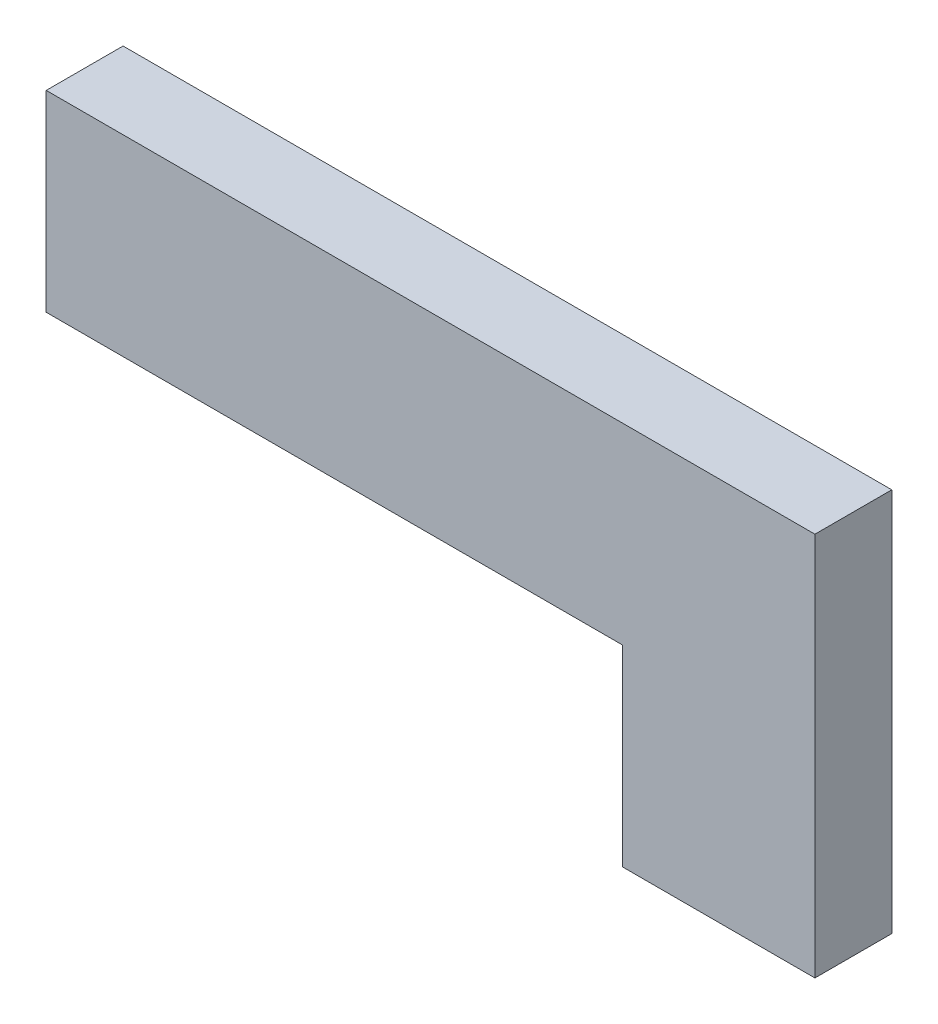
ISO-10303-21;
HEADER;
FILE_DESCRIPTION(('STEP AP214'),'2;1');
FILE_NAME('part.step','',(''),(''),'','','');
FILE_SCHEMA(('AUTOMOTIVE_DESIGN { 1 0 10303 214 1 1 1 1 }'));
ENDSEC;
DATA;
#1=APPLICATION_CONTEXT('core data for automotive mechanical design processes');
#2=APPLICATION_PROTOCOL_DEFINITION('international standard','automotive_design',2000,#1);
#3=PRODUCT_CONTEXT('',#1,'mechanical');
#4=PRODUCT('Part','Part','',(#3));
#5=PRODUCT_RELATED_PRODUCT_CATEGORY('part','',(#4));
#6=PRODUCT_DEFINITION_FORMATION('','',#4);
#7=PRODUCT_DEFINITION_CONTEXT('part definition',#1,'design');
#8=PRODUCT_DEFINITION('design','',#6,#7);
#9=PRODUCT_DEFINITION_SHAPE('','',#8);
#10=(LENGTH_UNIT() NAMED_UNIT(*) SI_UNIT(.MILLI.,.METRE.));
#11=(NAMED_UNIT(*) PLANE_ANGLE_UNIT() SI_UNIT($,.RADIAN.));
#12=(NAMED_UNIT(*) SI_UNIT($,.STERADIAN.) SOLID_ANGLE_UNIT());
#13=UNCERTAINTY_MEASURE_WITH_UNIT(LENGTH_MEASURE(1.E-05),#10,'distance_accuracy_value','');
#14=(GEOMETRIC_REPRESENTATION_CONTEXT(3) GLOBAL_UNCERTAINTY_ASSIGNED_CONTEXT((#13)) GLOBAL_UNIT_ASSIGNED_CONTEXT((#10,
#11,#12)) REPRESENTATION_CONTEXT('',''));
#15=CARTESIAN_POINT('',(0.,0.,0.));
#16=DIRECTION('',(0.,0.,1.));
#17=DIRECTION('',(1.,0.,0.));
#18=AXIS2_PLACEMENT_3D('',#15,#16,#17);
#19=CARTESIAN_POINT('',(0.,-5.,2.));
#20=DIRECTION('',(1.,0.,0.));
#21=DIRECTION('',(0.,1.,0.));
#22=AXIS2_PLACEMENT_3D('',#19,#20,#21);
#23=PLANE('',#22);
#24=DIRECTION('',(0.,-1.,0.));
#25=VECTOR('',#24,1.);
#26=CARTESIAN_POINT('',(0.,-5.,0.));
#27=LINE('',#26,#25);
#28=CARTESIAN_POINT('',(0.,0.,0.));
#29=VERTEX_POINT('',#28);
#30=CARTESIAN_POINT('',(0.,-5.,0.));
#31=VERTEX_POINT('',#30);
#32=EDGE_CURVE('E128',#29,#31,#27,.T.);
#33=ORIENTED_EDGE('',*,*,#32,.T.);
#34=DIRECTION('',(0.,0.,-1.));
#35=VECTOR('',#34,1.);
#36=CARTESIAN_POINT('',(0.,-5.,2.));
#37=LINE('',#36,#35);
#38=CARTESIAN_POINT('',(0.,-5.,2.));
#39=VERTEX_POINT('',#38);
#40=EDGE_CURVE('E11',#39,#31,#37,.T.);
#41=ORIENTED_EDGE('',*,*,#40,.F.);
#42=DIRECTION('',(0.,-1.,0.));
#43=VECTOR('',#42,1.);
#44=CARTESIAN_POINT('',(0.,-5.,2.));
#45=LINE('',#44,#43);
#46=CARTESIAN_POINT('',(0.,0.,2.));
#47=VERTEX_POINT('',#46);
#48=EDGE_CURVE('E144',#47,#39,#45,.T.);
#49=ORIENTED_EDGE('',*,*,#48,.F.);
#50=DIRECTION('',(0.,0.,-1.));
#51=VECTOR('',#50,1.);
#52=CARTESIAN_POINT('',(0.,0.,2.));
#53=LINE('',#52,#51);
#54=EDGE_CURVE('E124',#47,#29,#53,.T.);
#55=ORIENTED_EDGE('',*,*,#54,.T.);
#56=EDGE_LOOP('',(#33,#41,#49,#55));
#57=FACE_BOUND('',#56,.T.);
#58=ADVANCED_FACE('F39',(#57),#23,.F.);
#59=CARTESIAN_POINT('',(15.,-5.,2.));
#60=DIRECTION('',(0.,1.,0.));
#61=DIRECTION('',(-1.,0.,0.));
#62=AXIS2_PLACEMENT_3D('',#59,#60,#61);
#63=PLANE('',#62);
#64=DIRECTION('',(1.,0.,0.));
#65=VECTOR('',#64,1.);
#66=CARTESIAN_POINT('',(15.,-5.,0.));
#67=LINE('',#66,#65);
#68=CARTESIAN_POINT('',(15.,-5.,0.));
#69=VERTEX_POINT('',#68);
#70=EDGE_CURVE('E132',#31,#69,#67,.T.);
#71=ORIENTED_EDGE('',*,*,#70,.T.);
#72=DIRECTION('',(0.,0.,-1.));
#73=VECTOR('',#72,1.);
#74=CARTESIAN_POINT('',(15.,-5.,2.));
#75=LINE('',#74,#73);
#76=CARTESIAN_POINT('',(15.,-5.,2.));
#77=VERTEX_POINT('',#76);
#78=EDGE_CURVE('E48',#77,#69,#75,.T.);
#79=ORIENTED_EDGE('',*,*,#78,.F.);
#80=DIRECTION('',(1.,0.,0.));
#81=VECTOR('',#80,1.);
#82=CARTESIAN_POINT('',(15.,-5.,2.));
#83=LINE('',#82,#81);
#84=EDGE_CURVE('E93',#39,#77,#83,.T.);
#85=ORIENTED_EDGE('',*,*,#84,.F.);
#86=ORIENTED_EDGE('',*,*,#40,.T.);
#87=EDGE_LOOP('',(#71,#79,#85,#86));
#88=FACE_BOUND('',#87,.T.);
#89=ADVANCED_FACE('F172',(#88),#63,.F.);
#90=CARTESIAN_POINT('',(15.,-10.,2.));
#91=DIRECTION('',(1.,0.,0.));
#92=DIRECTION('',(0.,0.,-1.));
#93=AXIS2_PLACEMENT_3D('',#90,#91,#92);
#94=PLANE('',#93);
#95=DIRECTION('',(0.,-1.,0.));
#96=VECTOR('',#95,1.);
#97=CARTESIAN_POINT('',(15.,-10.,0.));
#98=LINE('',#97,#96);
#99=CARTESIAN_POINT('',(15.,-10.,0.));
#100=VERTEX_POINT('',#99);
#101=EDGE_CURVE('E135',#69,#100,#98,.T.);
#102=ORIENTED_EDGE('',*,*,#101,.T.);
#103=DIRECTION('',(0.,0.,-1.));
#104=VECTOR('',#103,1.);
#105=CARTESIAN_POINT('',(15.,-10.,2.));
#106=LINE('',#105,#104);
#107=CARTESIAN_POINT('',(15.,-10.,2.));
#108=VERTEX_POINT('',#107);
#109=EDGE_CURVE('E117',#108,#100,#106,.T.);
#110=ORIENTED_EDGE('',*,*,#109,.F.);
#111=DIRECTION('',(0.,-1.,0.));
#112=VECTOR('',#111,1.);
#113=CARTESIAN_POINT('',(15.,-10.,2.));
#114=LINE('',#113,#112);
#115=EDGE_CURVE('E106',#77,#108,#114,.T.);
#116=ORIENTED_EDGE('',*,*,#115,.F.);
#117=ORIENTED_EDGE('',*,*,#78,.T.);
#118=EDGE_LOOP('',(#102,#110,#116,#117));
#119=FACE_BOUND('',#118,.T.);
#120=ADVANCED_FACE('F154',(#119),#94,.F.);
#121=CARTESIAN_POINT('',(20.,-10.,2.));
#122=DIRECTION('',(0.,1.,0.));
#123=DIRECTION('',(-1.,0.,0.));
#124=AXIS2_PLACEMENT_3D('',#121,#122,#123);
#125=PLANE('',#124);
#126=DIRECTION('',(1.,0.,0.));
#127=VECTOR('',#126,1.);
#128=CARTESIAN_POINT('',(20.,-10.,0.));
#129=LINE('',#128,#127);
#130=CARTESIAN_POINT('',(20.,-10.,0.));
#131=VERTEX_POINT('',#130);
#132=EDGE_CURVE('E115',#100,#131,#129,.T.);
#133=ORIENTED_EDGE('',*,*,#132,.T.);
#134=DIRECTION('',(0.,0.,-1.));
#135=VECTOR('',#134,1.);
#136=CARTESIAN_POINT('',(20.,-10.,2.));
#137=LINE('',#136,#135);
#138=CARTESIAN_POINT('',(20.,-10.,2.));
#139=VERTEX_POINT('',#138);
#140=EDGE_CURVE('E112',#139,#131,#137,.T.);
#141=ORIENTED_EDGE('',*,*,#140,.F.);
#142=DIRECTION('',(1.,0.,0.));
#143=VECTOR('',#142,1.);
#144=CARTESIAN_POINT('',(20.,-10.,2.));
#145=LINE('',#144,#143);
#146=EDGE_CURVE('E100',#108,#139,#145,.T.);
#147=ORIENTED_EDGE('',*,*,#146,.F.);
#148=ORIENTED_EDGE('',*,*,#109,.T.);
#149=EDGE_LOOP('',(#133,#141,#147,#148));
#150=FACE_BOUND('',#149,.T.);
#151=ADVANCED_FACE('F113',(#150),#125,.F.);
#152=CARTESIAN_POINT('',(20.,0.,2.));
#153=DIRECTION('',(-1.,0.,0.));
#154=DIRECTION('',(0.,0.,1.));
#155=AXIS2_PLACEMENT_3D('',#152,#153,#154);
#156=PLANE('',#155);
#157=DIRECTION('',(0.,1.,0.));
#158=VECTOR('',#157,1.);
#159=CARTESIAN_POINT('',(20.,0.,0.));
#160=LINE('',#159,#158);
#161=CARTESIAN_POINT('',(20.,0.,0.));
#162=VERTEX_POINT('',#161);
#163=EDGE_CURVE('E79',#131,#162,#160,.T.);
#164=ORIENTED_EDGE('',*,*,#163,.T.);
#165=DIRECTION('',(0.,0.,-1.));
#166=VECTOR('',#165,1.);
#167=CARTESIAN_POINT('',(20.,0.,2.));
#168=LINE('',#167,#166);
#169=CARTESIAN_POINT('',(20.,0.,2.));
#170=VERTEX_POINT('',#169);
#171=EDGE_CURVE('E118',#170,#162,#168,.T.);
#172=ORIENTED_EDGE('',*,*,#171,.F.);
#173=DIRECTION('',(0.,1.,0.));
#174=VECTOR('',#173,1.);
#175=CARTESIAN_POINT('',(20.,0.,2.));
#176=LINE('',#175,#174);
#177=EDGE_CURVE('E104',#139,#170,#176,.T.);
#178=ORIENTED_EDGE('',*,*,#177,.F.);
#179=ORIENTED_EDGE('',*,*,#140,.T.);
#180=EDGE_LOOP('',(#164,#172,#178,#179));
#181=FACE_BOUND('',#180,.T.);
#182=ADVANCED_FACE('F120',(#181),#156,.F.);
#183=CARTESIAN_POINT('',(0.,0.,2.));
#184=DIRECTION('',(0.,-1.,0.));
#185=DIRECTION('',(0.,0.,-1.));
#186=AXIS2_PLACEMENT_3D('',#183,#184,#185);
#187=PLANE('',#186);
#188=DIRECTION('',(-1.,0.,0.));
#189=VECTOR('',#188,1.);
#190=CARTESIAN_POINT('',(0.,0.,0.));
#191=LINE('',#190,#189);
#192=EDGE_CURVE('E85',#162,#29,#191,.T.);
#193=ORIENTED_EDGE('',*,*,#192,.T.);
#194=ORIENTED_EDGE('',*,*,#54,.F.);
#195=DIRECTION('',(-1.,0.,0.));
#196=VECTOR('',#195,1.);
#197=CARTESIAN_POINT('',(0.,0.,2.));
#198=LINE('',#197,#196);
#199=EDGE_CURVE('E56',#170,#47,#198,.T.);
#200=ORIENTED_EDGE('',*,*,#199,.F.);
#201=ORIENTED_EDGE('',*,*,#171,.T.);
#202=EDGE_LOOP('',(#193,#194,#200,#201));
#203=FACE_BOUND('',#202,.T.);
#204=ADVANCED_FACE('F161',(#203),#187,.F.);
#205=CARTESIAN_POINT('',(0.,0.,2.));
#206=DIRECTION('',(0.,0.,-1.));
#207=DIRECTION('',(-1.,0.,0.));
#208=AXIS2_PLACEMENT_3D('',#205,#206,#207);
#209=PLANE('',#208);
#210=ORIENTED_EDGE('',*,*,#48,.T.);
#211=ORIENTED_EDGE('',*,*,#84,.T.);
#212=ORIENTED_EDGE('',*,*,#115,.T.);
#213=ORIENTED_EDGE('',*,*,#146,.T.);
#214=ORIENTED_EDGE('',*,*,#177,.T.);
#215=ORIENTED_EDGE('',*,*,#199,.T.);
#216=EDGE_LOOP('',(#210,#211,#212,#213,#214,#215));
#217=FACE_BOUND('',#216,.T.);
#218=ADVANCED_FACE('F102',(#217),#209,.F.);
#219=CARTESIAN_POINT('',(0.,0.,0.));
#220=DIRECTION('',(0.,0.,-1.));
#221=DIRECTION('',(-1.,0.,0.));
#222=AXIS2_PLACEMENT_3D('',#219,#220,#221);
#223=PLANE('',#222);
#224=ORIENTED_EDGE('',*,*,#32,.F.);
#225=ORIENTED_EDGE('',*,*,#192,.F.);
#226=ORIENTED_EDGE('',*,*,#163,.F.);
#227=ORIENTED_EDGE('',*,*,#132,.F.);
#228=ORIENTED_EDGE('',*,*,#101,.F.);
#229=ORIENTED_EDGE('',*,*,#70,.F.);
#230=EDGE_LOOP('',(#224,#225,#226,#227,#228,#229));
#231=FACE_BOUND('',#230,.T.);
#232=ADVANCED_FACE('F157',(#231),#223,.T.);
#233=CLOSED_SHELL('',(#58,#89,#120,#151,#182,#204,#218,#232));
#234=MANIFOLD_SOLID_BREP('B2',#233);
#235=ADVANCED_BREP_SHAPE_REPRESENTATION('',(#18,#234),#14);
#236=SHAPE_DEFINITION_REPRESENTATION(#9,#235);
ENDSEC;
END-ISO-10303-21;
